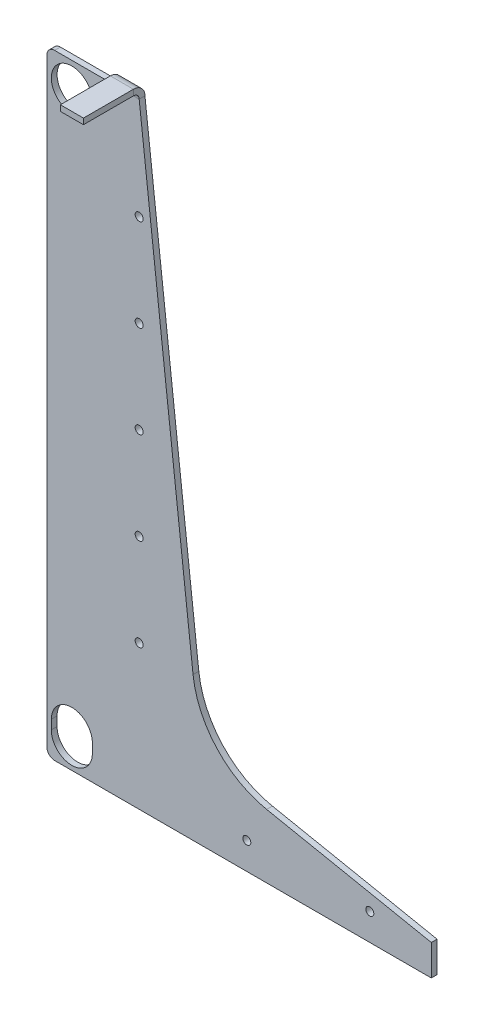
ISO-10303-21;
HEADER;
FILE_DESCRIPTION(('STEP AP214'),'2;1');
FILE_NAME('part.step','',(''),(''),'','','');
FILE_SCHEMA(('AUTOMOTIVE_DESIGN { 1 0 10303 214 1 1 1 1 }'));
ENDSEC;
DATA;
#1=APPLICATION_CONTEXT('core data for automotive mechanical design processes');
#2=APPLICATION_PROTOCOL_DEFINITION('international standard','automotive_design',2000,#1);
#3=PRODUCT_CONTEXT('',#1,'mechanical');
#4=PRODUCT('Part','Part','',(#3));
#5=PRODUCT_RELATED_PRODUCT_CATEGORY('part','',(#4));
#6=PRODUCT_DEFINITION_FORMATION('','',#4);
#7=PRODUCT_DEFINITION_CONTEXT('part definition',#1,'design');
#8=PRODUCT_DEFINITION('design','',#6,#7);
#9=PRODUCT_DEFINITION_SHAPE('','',#8);
#10=(LENGTH_UNIT() NAMED_UNIT(*) SI_UNIT(.MILLI.,.METRE.));
#11=(NAMED_UNIT(*) PLANE_ANGLE_UNIT() SI_UNIT($,.RADIAN.));
#12=(NAMED_UNIT(*) SI_UNIT($,.STERADIAN.) SOLID_ANGLE_UNIT());
#13=UNCERTAINTY_MEASURE_WITH_UNIT(LENGTH_MEASURE(1.E-05),#10,'distance_accuracy_value','');
#14=(GEOMETRIC_REPRESENTATION_CONTEXT(3) GLOBAL_UNCERTAINTY_ASSIGNED_CONTEXT((#13)) GLOBAL_UNIT_ASSIGNED_CONTEXT((#10,
#11,#12)) REPRESENTATION_CONTEXT('',''));
#15=CARTESIAN_POINT('',(0.,0.,0.));
#16=DIRECTION('',(0.,0.,1.));
#17=DIRECTION('',(1.,0.,0.));
#18=AXIS2_PLACEMENT_3D('',#15,#16,#17);
#19=CARTESIAN_POINT('',(6.35,508.,3.175));
#20=DIRECTION('',(0.,-1.,0.));
#21=DIRECTION('',(-1.,0.,0.));
#22=AXIS2_PLACEMENT_3D('',#19,#20,#21);
#23=PLANE('',#22);
#24=DIRECTION('',(-1.,0.,0.));
#25=VECTOR('',#24,1.);
#26=CARTESIAN_POINT('',(6.35,508.,3.175));
#27=LINE('',#26,#25);
#28=CARTESIAN_POINT('',(57.15,508.,3.17500000000017));
#29=VERTEX_POINT('',#28);
#30=CARTESIAN_POINT('',(6.35,508.,3.175));
#31=VERTEX_POINT('',#30);
#32=EDGE_CURVE('E316',#29,#31,#27,.T.);
#33=ORIENTED_EDGE('',*,*,#32,.F.);
#34=DIRECTION('',(0.,0.,-1.));
#35=VECTOR('',#34,1.);
#36=CARTESIAN_POINT('',(57.15,508.,3.17500000000017));
#37=LINE('',#36,#35);
#38=CARTESIAN_POINT('',(57.15,508.,-1.5875));
#39=VERTEX_POINT('',#38);
#40=EDGE_CURVE('E287',#29,#39,#37,.T.);
#41=ORIENTED_EDGE('',*,*,#40,.T.);
#42=DIRECTION('',(-1.,0.,0.));
#43=VECTOR('',#42,1.);
#44=CARTESIAN_POINT('',(6.35,508.,-1.5875));
#45=LINE('',#44,#43);
#46=CARTESIAN_POINT('',(6.35,508.,-1.5875));
#47=VERTEX_POINT('',#46);
#48=EDGE_CURVE('E353',#39,#47,#45,.T.);
#49=ORIENTED_EDGE('',*,*,#48,.T.);
#50=DIRECTION('',(0.,0.,1.));
#51=VECTOR('',#50,1.);
#52=CARTESIAN_POINT('',(6.35,508.,3.175));
#53=LINE('',#52,#51);
#54=EDGE_CURVE('E370',#47,#31,#53,.T.);
#55=ORIENTED_EDGE('',*,*,#54,.T.);
#56=EDGE_LOOP('',(#33,#41,#49,#55));
#57=FACE_BOUND('',#56,.T.);
#58=ADVANCED_FACE('F54',(#57),#23,.F.);
#59=CARTESIAN_POINT('',(196.401298520813,127.328797682991,3.175));
#60=DIRECTION('',(0.,0.,-1.));
#61=DIRECTION('',(-1.,0.,0.));
#62=AXIS2_PLACEMENT_3D('',#59,#60,#61);
#63=CYLINDRICAL_SURFACE('',#62,76.2);
#64=DIRECTION('',(0.,0.,1.));
#65=VECTOR('',#64,1.);
#66=CARTESIAN_POINT('',(181.457249023283,52.6085501953433,3.175));
#67=LINE('',#66,#65);
#68=CARTESIAN_POINT('',(181.457249023283,52.6085501953433,-1.5875));
#69=VERTEX_POINT('',#68);
#70=CARTESIAN_POINT('',(181.457249023283,52.6085501953433,3.175));
#71=VERTEX_POINT('',#70);
#72=EDGE_CURVE('E13',#69,#71,#67,.T.);
#73=ORIENTED_EDGE('',*,*,#72,.F.);
#74=CARTESIAN_POINT('',(196.401298520813,127.328797682991,-1.5875));
#75=DIRECTION('',(0.,0.,-1.));
#76=DIRECTION('',(-1.,0.,0.));
#77=AXIS2_PLACEMENT_3D('',#74,#75,#76);
#78=CIRCLE('',#77,76.2);
#79=CARTESIAN_POINT('',(120.694108864395,118.676547436544,-1.5875));
#80=VERTEX_POINT('',#79);
#81=EDGE_CURVE('E357',#69,#80,#78,.T.);
#82=ORIENTED_EDGE('',*,*,#81,.T.);
#83=DIRECTION('',(0.,0.,1.));
#84=VECTOR('',#83,1.);
#85=CARTESIAN_POINT('',(120.694108864395,118.676547436544,3.175));
#86=LINE('',#85,#84);
#87=CARTESIAN_POINT('',(120.694108864395,118.676547436544,3.175));
#88=VERTEX_POINT('',#87);
#89=EDGE_CURVE('E63',#80,#88,#86,.T.);
#90=ORIENTED_EDGE('',*,*,#89,.T.);
#91=CARTESIAN_POINT('',(196.401298520813,127.328797682991,3.175));
#92=DIRECTION('',(0.,0.,-1.));
#93=DIRECTION('',(1.,0.,0.));
#94=AXIS2_PLACEMENT_3D('',#91,#92,#93);
#95=CIRCLE('',#94,76.2);
#96=EDGE_CURVE('E310',#71,#88,#95,.T.);
#97=ORIENTED_EDGE('',*,*,#96,.F.);
#98=EDGE_LOOP('',(#73,#82,#90,#97));
#99=FACE_BOUND('',#98,.T.);
#100=ADVANCED_FACE('F378',(#99),#63,.F.);
#101=CARTESIAN_POINT('',(76.2,508.,3.175));
#102=DIRECTION('',(-0.993532672656404,-0.113546591160732,0.));
#103=DIRECTION('',(-0.113546591160732,0.993532672656404,0.));
#104=AXIS2_PLACEMENT_3D('',#101,#102,#103);
#105=PLANE('',#104);
#106=ORIENTED_EDGE('',*,*,#89,.F.);
#107=DIRECTION('',(-0.113546591160732,0.993532672656404,0.));
#108=VECTOR('',#107,1.);
#109=CARTESIAN_POINT('',(76.2,508.,-1.5875));
#110=LINE('',#109,#108);
#111=CARTESIAN_POINT('',(76.2,508.,-1.58749999999994));
#112=VERTEX_POINT('',#111);
#113=EDGE_CURVE('E354',#80,#112,#110,.T.);
#114=ORIENTED_EDGE('',*,*,#113,.T.);
#115=DIRECTION('',(0.,0.,1.));
#116=VECTOR('',#115,1.);
#117=CARTESIAN_POINT('',(76.2,508.,3.175));
#118=LINE('',#117,#116);
#119=CARTESIAN_POINT('',(76.2,508.,3.17500000000006));
#120=VERTEX_POINT('',#119);
#121=EDGE_CURVE('E373',#112,#120,#118,.T.);
#122=ORIENTED_EDGE('',*,*,#121,.T.);
#123=DIRECTION('',(-0.113546591160732,0.993532672656404,0.));
#124=VECTOR('',#123,1.);
#125=CARTESIAN_POINT('',(76.2,508.,3.175));
#126=LINE('',#125,#124);
#127=EDGE_CURVE('E313',#88,#120,#126,.T.);
#128=ORIENTED_EDGE('',*,*,#127,.F.);
#129=EDGE_LOOP('',(#106,#114,#122,#128));
#130=FACE_BOUND('',#129,.T.);
#131=ADVANCED_FACE('F386',(#130),#105,.F.);
#132=CARTESIAN_POINT('',(6.35,501.65,3.175));
#133=DIRECTION('',(0.,0.,1.));
#134=DIRECTION('',(1.,0.,0.));
#135=AXIS2_PLACEMENT_3D('',#132,#133,#134);
#136=CYLINDRICAL_SURFACE('',#135,6.34999999999993);
#137=ORIENTED_EDGE('',*,*,#54,.F.);
#138=CARTESIAN_POINT('',(6.35,501.65,-1.5875));
#139=DIRECTION('',(0.,0.,1.));
#140=DIRECTION('',(1.,0.,0.));
#141=AXIS2_PLACEMENT_3D('',#138,#139,#140);
#142=CIRCLE('',#141,6.34999999999993);
#143=CARTESIAN_POINT('',(0.,501.65,-1.5875));
#144=VERTEX_POINT('',#143);
#145=EDGE_CURVE('E348',#47,#144,#142,.T.);
#146=ORIENTED_EDGE('',*,*,#145,.T.);
#147=DIRECTION('',(0.,0.,1.));
#148=VECTOR('',#147,1.);
#149=CARTESIAN_POINT('',(0.,501.65,3.175));
#150=LINE('',#149,#148);
#151=CARTESIAN_POINT('',(0.,501.65,3.175));
#152=VERTEX_POINT('',#151);
#153=EDGE_CURVE('E368',#144,#152,#150,.T.);
#154=ORIENTED_EDGE('',*,*,#153,.T.);
#155=CARTESIAN_POINT('',(6.35,501.65,3.175));
#156=DIRECTION('',(0.,0.,1.));
#157=DIRECTION('',(-1.,0.,0.));
#158=AXIS2_PLACEMENT_3D('',#155,#156,#157);
#159=CIRCLE('',#158,6.34999999999993);
#160=EDGE_CURVE('E320',#31,#152,#159,.T.);
#161=ORIENTED_EDGE('',*,*,#160,.F.);
#162=EDGE_LOOP('',(#137,#146,#154,#161));
#163=FACE_BOUND('',#162,.T.);
#164=ADVANCED_FACE('F405',(#163),#136,.T.);
#165=CARTESIAN_POINT('',(0.,6.35,3.175));
#166=DIRECTION('',(1.,0.,0.));
#167=DIRECTION('',(0.,-1.,0.));
#168=AXIS2_PLACEMENT_3D('',#165,#166,#167);
#169=PLANE('',#168);
#170=ORIENTED_EDGE('',*,*,#153,.F.);
#171=DIRECTION('',(0.,1.,0.));
#172=VECTOR('',#171,1.);
#173=CARTESIAN_POINT('',(0.,6.35,-1.5875));
#174=LINE('',#173,#172);
#175=CARTESIAN_POINT('',(0.,6.35,-1.5875));
#176=VERTEX_POINT('',#175);
#177=EDGE_CURVE('E345',#144,#176,#174,.F.);
#178=ORIENTED_EDGE('',*,*,#177,.T.);
#179=DIRECTION('',(0.,0.,1.));
#180=VECTOR('',#179,1.);
#181=CARTESIAN_POINT('',(0.,6.35,3.175));
#182=LINE('',#181,#180);
#183=CARTESIAN_POINT('',(0.,6.35,3.175));
#184=VERTEX_POINT('',#183);
#185=EDGE_CURVE('E366',#176,#184,#182,.T.);
#186=ORIENTED_EDGE('',*,*,#185,.T.);
#187=DIRECTION('',(0.,-1.,0.));
#188=VECTOR('',#187,1.);
#189=CARTESIAN_POINT('',(0.,6.35,3.175));
#190=LINE('',#189,#188);
#191=EDGE_CURVE('E323',#152,#184,#190,.T.);
#192=ORIENTED_EDGE('',*,*,#191,.F.);
#193=EDGE_LOOP('',(#170,#178,#186,#192));
#194=FACE_BOUND('',#193,.T.);
#195=ADVANCED_FACE('F409',(#194),#169,.F.);
#196=CARTESIAN_POINT('',(6.35,6.35,3.175));
#197=DIRECTION('',(0.,0.,1.));
#198=DIRECTION('',(1.,0.,0.));
#199=AXIS2_PLACEMENT_3D('',#196,#197,#198);
#200=CYLINDRICAL_SURFACE('',#199,6.35);
#201=ORIENTED_EDGE('',*,*,#185,.F.);
#202=CARTESIAN_POINT('',(6.35,6.35,-1.5875));
#203=DIRECTION('',(0.,0.,1.));
#204=DIRECTION('',(1.,0.,0.));
#205=AXIS2_PLACEMENT_3D('',#202,#203,#204);
#206=CIRCLE('',#205,6.35);
#207=CARTESIAN_POINT('',(6.35,0.,-1.5875));
#208=VERTEX_POINT('',#207);
#209=EDGE_CURVE('E342',#176,#208,#206,.T.);
#210=ORIENTED_EDGE('',*,*,#209,.T.);
#211=DIRECTION('',(0.,0.,1.));
#212=VECTOR('',#211,1.);
#213=CARTESIAN_POINT('',(6.35,0.,3.175));
#214=LINE('',#213,#212);
#215=CARTESIAN_POINT('',(6.35,0.,3.175));
#216=VERTEX_POINT('',#215);
#217=EDGE_CURVE('E364',#208,#216,#214,.T.);
#218=ORIENTED_EDGE('',*,*,#217,.T.);
#219=CARTESIAN_POINT('',(6.35,6.35,3.175));
#220=DIRECTION('',(0.,0.,1.));
#221=DIRECTION('',(-1.,0.,0.));
#222=AXIS2_PLACEMENT_3D('',#219,#220,#221);
#223=CIRCLE('',#222,6.35);
#224=EDGE_CURVE('E326',#184,#216,#223,.T.);
#225=ORIENTED_EDGE('',*,*,#224,.F.);
#226=EDGE_LOOP('',(#201,#210,#218,#225));
#227=FACE_BOUND('',#226,.T.);
#228=ADVANCED_FACE('F412',(#227),#200,.T.);
#229=CARTESIAN_POINT('',(6.35,0.,3.175));
#230=DIRECTION('',(0.,1.,0.));
#231=DIRECTION('',(1.,0.,0.));
#232=AXIS2_PLACEMENT_3D('',#229,#230,#231);
#233=PLANE('',#232);
#234=ORIENTED_EDGE('',*,*,#217,.F.);
#235=DIRECTION('',(-1.,0.,0.));
#236=VECTOR('',#235,1.);
#237=CARTESIAN_POINT('',(6.35,0.,-1.5875));
#238=LINE('',#237,#236);
#239=CARTESIAN_POINT('',(317.5,0.,-1.5875));
#240=VERTEX_POINT('',#239);
#241=EDGE_CURVE('E301',#208,#240,#238,.F.);
#242=ORIENTED_EDGE('',*,*,#241,.T.);
#243=DIRECTION('',(0.,0.,1.));
#244=VECTOR('',#243,1.);
#245=CARTESIAN_POINT('',(317.5,0.,3.175));
#246=LINE('',#245,#244);
#247=CARTESIAN_POINT('',(317.5,0.,3.175));
#248=VERTEX_POINT('',#247);
#249=EDGE_CURVE('E362',#240,#248,#246,.T.);
#250=ORIENTED_EDGE('',*,*,#249,.T.);
#251=DIRECTION('',(1.,0.,0.));
#252=VECTOR('',#251,1.);
#253=CARTESIAN_POINT('',(6.35,0.,3.175));
#254=LINE('',#253,#252);
#255=EDGE_CURVE('E329',#216,#248,#254,.T.);
#256=ORIENTED_EDGE('',*,*,#255,.F.);
#257=EDGE_LOOP('',(#234,#242,#250,#256));
#258=FACE_BOUND('',#257,.T.);
#259=ADVANCED_FACE('F416',(#258),#233,.F.);
#260=CARTESIAN_POINT('',(317.5,25.4,3.175));
#261=DIRECTION('',(-1.,0.,0.));
#262=DIRECTION('',(0.,1.,0.));
#263=AXIS2_PLACEMENT_3D('',#260,#261,#262);
#264=PLANE('',#263);
#265=ORIENTED_EDGE('',*,*,#249,.F.);
#266=DIRECTION('',(0.,1.,0.));
#267=VECTOR('',#266,1.);
#268=CARTESIAN_POINT('',(317.5,6.35,-1.5875));
#269=LINE('',#268,#267);
#270=CARTESIAN_POINT('',(317.5,25.4,-1.5875));
#271=VERTEX_POINT('',#270);
#272=EDGE_CURVE('E336',#240,#271,#269,.T.);
#273=ORIENTED_EDGE('',*,*,#272,.T.);
#274=DIRECTION('',(0.,0.,1.));
#275=VECTOR('',#274,1.);
#276=CARTESIAN_POINT('',(317.5,25.4,3.175));
#277=LINE('',#276,#275);
#278=CARTESIAN_POINT('',(317.5,25.4,3.175));
#279=VERTEX_POINT('',#278);
#280=EDGE_CURVE('E58',#271,#279,#277,.T.);
#281=ORIENTED_EDGE('',*,*,#280,.T.);
#282=DIRECTION('',(0.,1.,0.));
#283=VECTOR('',#282,1.);
#284=CARTESIAN_POINT('',(317.5,25.4,3.175));
#285=LINE('',#284,#283);
#286=EDGE_CURVE('E304',#248,#279,#285,.T.);
#287=ORIENTED_EDGE('',*,*,#286,.F.);
#288=EDGE_LOOP('',(#265,#273,#281,#287));
#289=FACE_BOUND('',#288,.T.);
#290=ADVANCED_FACE('F421',(#289),#264,.F.);
#291=CARTESIAN_POINT('',(20.5739999999999,20.574,3.175));
#292=DIRECTION('',(0.,0.,1.));
#293=DIRECTION('',(1.,0.,0.));
#294=AXIS2_PLACEMENT_3D('',#291,#292,#293);
#295=CYLINDRICAL_SURFACE('',#294,16.9545);
#296=DIRECTION('',(0.,0.,1.));
#297=VECTOR('',#296,1.);
#298=CARTESIAN_POINT('',(37.5284999999999,20.574,-1.5875));
#299=LINE('',#298,#297);
#300=CARTESIAN_POINT('',(37.5284999999999,20.574,-1.5875));
#301=VERTEX_POINT('',#300);
#302=CARTESIAN_POINT('',(37.5284999999999,20.574,3.175));
#303=VERTEX_POINT('',#302);
#304=EDGE_CURVE('E210',#301,#303,#299,.T.);
#305=ORIENTED_EDGE('',*,*,#304,.F.);
#306=CARTESIAN_POINT('',(20.5739999999999,20.574,-1.5875));
#307=DIRECTION('',(0.,0.,1.));
#308=DIRECTION('',(1.,0.,0.));
#309=AXIS2_PLACEMENT_3D('',#306,#307,#308);
#310=CIRCLE('',#309,16.9545);
#311=CARTESIAN_POINT('',(3.61949999999991,20.5740000000002,-1.5875));
#312=VERTEX_POINT('',#311);
#313=EDGE_CURVE('E296',#312,#301,#310,.T.);
#314=ORIENTED_EDGE('',*,*,#313,.F.);
#315=DIRECTION('',(0.,0.,1.));
#316=VECTOR('',#315,1.);
#317=CARTESIAN_POINT('',(3.61949999999991,20.574,-1.5875));
#318=LINE('',#317,#316);
#319=CARTESIAN_POINT('',(3.61949999999991,20.574,3.175));
#320=VERTEX_POINT('',#319);
#321=EDGE_CURVE('E70',#312,#320,#318,.T.);
#322=ORIENTED_EDGE('',*,*,#321,.T.);
#323=CARTESIAN_POINT('',(20.5739999999999,20.574,3.175));
#324=DIRECTION('',(0.,0.,1.));
#325=DIRECTION('',(1.,0.,0.));
#326=AXIS2_PLACEMENT_3D('',#323,#324,#325);
#327=CIRCLE('',#326,16.9545);
#328=EDGE_CURVE('E297',#320,#303,#327,.T.);
#329=ORIENTED_EDGE('',*,*,#328,.T.);
#330=EDGE_LOOP('',(#305,#314,#322,#329));
#331=FACE_BOUND('',#330,.T.);
#332=ADVANCED_FACE('F423',(#331),#295,.F.);
#333=CARTESIAN_POINT('',(20.574,486.9942,3.175));
#334=DIRECTION('',(0.,0.,1.));
#335=DIRECTION('',(1.,0.,0.));
#336=AXIS2_PLACEMENT_3D('',#333,#334,#335);
#337=CYLINDRICAL_SURFACE('',#336,16.9545);
#338=CARTESIAN_POINT('',(20.574,486.9942,3.175));
#339=DIRECTION('',(0.,0.,1.));
#340=DIRECTION('',(1.,0.,0.));
#341=AXIS2_PLACEMENT_3D('',#338,#339,#340);
#342=CIRCLE('',#341,16.9545);
#343=CARTESIAN_POINT('',(37.5285,486.9942,3.175));
#344=VERTEX_POINT('',#343);
#345=EDGE_CURVE('E300',#344,#344,#342,.T.);
#346=ORIENTED_EDGE('',*,*,#345,.T.);
#347=EDGE_LOOP('',(#346));
#348=FACE_BOUND('',#347,.T.);
#349=CARTESIAN_POINT('',(20.574,486.9942,-1.5875));
#350=DIRECTION('',(0.,0.,1.));
#351=DIRECTION('',(1.,0.,0.));
#352=AXIS2_PLACEMENT_3D('',#349,#350,#351);
#353=CIRCLE('',#352,16.9545);
#354=CARTESIAN_POINT('',(37.5285,486.9942,-1.5875));
#355=VERTEX_POINT('',#354);
#356=EDGE_CURVE('E333',#355,#355,#353,.T.);
#357=ORIENTED_EDGE('',*,*,#356,.F.);
#358=EDGE_LOOP('',(#357));
#359=FACE_BOUND('',#358,.T.);
#360=ADVANCED_FACE('F429',(#348,#359),#337,.F.);
#361=CARTESIAN_POINT('',(181.457249023283,52.6085501953433,3.175));
#362=DIRECTION('',(-0.196116135138184,-0.98058067569092,0.));
#363=DIRECTION('',(-0.98058067569092,0.196116135138184,0.));
#364=AXIS2_PLACEMENT_3D('',#361,#362,#363);
#365=PLANE('',#364);
#366=DIRECTION('',(-0.98058067569092,0.196116135138184,0.));
#367=VECTOR('',#366,1.);
#368=CARTESIAN_POINT('',(181.457249023283,52.6085501953433,-1.5875));
#369=LINE('',#368,#367);
#370=EDGE_CURVE('E339',#271,#69,#369,.T.);
#371=ORIENTED_EDGE('',*,*,#370,.T.);
#372=ORIENTED_EDGE('',*,*,#72,.T.);
#373=DIRECTION('',(-0.98058067569092,0.196116135138184,0.));
#374=VECTOR('',#373,1.);
#375=CARTESIAN_POINT('',(181.457249023283,52.6085501953433,3.175));
#376=LINE('',#375,#374);
#377=EDGE_CURVE('E307',#279,#71,#376,.T.);
#378=ORIENTED_EDGE('',*,*,#377,.F.);
#379=ORIENTED_EDGE('',*,*,#280,.F.);
#380=EDGE_LOOP('',(#371,#372,#378,#379));
#381=FACE_BOUND('',#380,.T.);
#382=ADVANCED_FACE('F56',(#381),#365,.F.);
#383=CARTESIAN_POINT('',(6.35,6.35,3.175));
#384=DIRECTION('',(0.,0.,-1.));
#385=DIRECTION('',(-1.,0.,0.));
#386=AXIS2_PLACEMENT_3D('',#383,#384,#385);
#387=PLANE('',#386);
#388=CARTESIAN_POINT('',(165.1,22.2249999999996,3.175));
#389=DIRECTION('',(0.,0.,1.));
#390=DIRECTION('',(1.,0.,0.));
#391=AXIS2_PLACEMENT_3D('',#388,#389,#390);
#392=CIRCLE('',#391,3.30200000000001);
#393=CARTESIAN_POINT('',(168.402,22.2249999999996,3.175));
#394=VERTEX_POINT('',#393);
#395=EDGE_CURVE('E209',#394,#394,#392,.T.);
#396=ORIENTED_EDGE('',*,*,#395,.F.);
#397=EDGE_LOOP('',(#396));
#398=FACE_BOUND('',#397,.T.);
#399=CARTESIAN_POINT('',(266.7,22.2249999999996,3.175));
#400=DIRECTION('',(0.,0.,1.));
#401=DIRECTION('',(1.,0.,0.));
#402=AXIS2_PLACEMENT_3D('',#399,#400,#401);
#403=CIRCLE('',#402,3.30200000000004);
#404=CARTESIAN_POINT('',(270.002,22.2249999999996,3.175));
#405=VERTEX_POINT('',#404);
#406=EDGE_CURVE('E216',#405,#405,#403,.T.);
#407=ORIENTED_EDGE('',*,*,#406,.F.);
#408=EDGE_LOOP('',(#407));
#409=FACE_BOUND('',#408,.T.);
#410=CARTESIAN_POINT('',(76.2,119.092006341826,3.175));
#411=DIRECTION('',(0.,0.,1.));
#412=DIRECTION('',(1.,0.,0.));
#413=AXIS2_PLACEMENT_3D('',#410,#411,#412);
#414=CIRCLE('',#413,3.302);
#415=CARTESIAN_POINT('',(79.502,119.092006341826,3.175));
#416=VERTEX_POINT('',#415);
#417=EDGE_CURVE('E222',#416,#416,#414,.T.);
#418=ORIENTED_EDGE('',*,*,#417,.F.);
#419=EDGE_LOOP('',(#418));
#420=FACE_BOUND('',#419,.T.);
#421=CARTESIAN_POINT('',(76.2,195.292006341826,3.175));
#422=DIRECTION('',(0.,0.,1.));
#423=DIRECTION('',(1.,0.,0.));
#424=AXIS2_PLACEMENT_3D('',#421,#422,#423);
#425=CIRCLE('',#424,3.302);
#426=CARTESIAN_POINT('',(79.502,195.292006341826,3.175));
#427=VERTEX_POINT('',#426);
#428=EDGE_CURVE('E228',#427,#427,#425,.T.);
#429=ORIENTED_EDGE('',*,*,#428,.F.);
#430=EDGE_LOOP('',(#429));
#431=FACE_BOUND('',#430,.T.);
#432=CARTESIAN_POINT('',(76.2,271.492006341826,3.175));
#433=DIRECTION('',(0.,0.,1.));
#434=DIRECTION('',(1.,0.,0.));
#435=AXIS2_PLACEMENT_3D('',#432,#433,#434);
#436=CIRCLE('',#435,3.302);
#437=CARTESIAN_POINT('',(79.502,271.492006341826,3.175));
#438=VERTEX_POINT('',#437);
#439=EDGE_CURVE('E234',#438,#438,#436,.T.);
#440=ORIENTED_EDGE('',*,*,#439,.F.);
#441=EDGE_LOOP('',(#440));
#442=FACE_BOUND('',#441,.T.);
#443=CARTESIAN_POINT('',(76.2,347.692006341826,3.175));
#444=DIRECTION('',(0.,0.,1.));
#445=DIRECTION('',(1.,0.,0.));
#446=AXIS2_PLACEMENT_3D('',#443,#444,#445);
#447=CIRCLE('',#446,3.302);
#448=CARTESIAN_POINT('',(79.502,347.692006341826,3.175));
#449=VERTEX_POINT('',#448);
#450=EDGE_CURVE('E240',#449,#449,#447,.T.);
#451=ORIENTED_EDGE('',*,*,#450,.F.);
#452=EDGE_LOOP('',(#451));
#453=FACE_BOUND('',#452,.T.);
#454=CARTESIAN_POINT('',(76.2,423.892006341826,3.175));
#455=DIRECTION('',(0.,0.,1.));
#456=DIRECTION('',(1.,0.,0.));
#457=AXIS2_PLACEMENT_3D('',#454,#455,#456);
#458=CIRCLE('',#457,3.302);
#459=CARTESIAN_POINT('',(79.502,423.892006341826,3.175));
#460=VERTEX_POINT('',#459);
#461=EDGE_CURVE('E246',#460,#460,#458,.T.);
#462=ORIENTED_EDGE('',*,*,#461,.F.);
#463=EDGE_LOOP('',(#462));
#464=FACE_BOUND('',#463,.T.);
#465=CARTESIAN_POINT('',(20.574,28.2067,3.175));
#466=DIRECTION('',(0.,0.,1.));
#467=DIRECTION('',(1.,0.,0.));
#468=AXIS2_PLACEMENT_3D('',#465,#466,#467);
#469=CIRCLE('',#468,16.9545);
#470=CARTESIAN_POINT('',(37.5285,28.2067,3.175));
#471=VERTEX_POINT('',#470);
#472=CARTESIAN_POINT('',(3.61949999999999,28.2067,3.175));
#473=VERTEX_POINT('',#472);
#474=EDGE_CURVE('E186',#471,#473,#469,.T.);
#475=ORIENTED_EDGE('',*,*,#474,.F.);
#476=DIRECTION('',(0.,1.,0.));
#477=VECTOR('',#476,1.);
#478=CARTESIAN_POINT('',(37.5285,28.2067,3.175));
#479=LINE('',#478,#477);
#480=EDGE_CURVE('E198',#303,#471,#479,.T.);
#481=ORIENTED_EDGE('',*,*,#480,.F.);
#482=ORIENTED_EDGE('',*,*,#328,.F.);
#483=DIRECTION('',(0.,-1.,0.));
#484=VECTOR('',#483,1.);
#485=CARTESIAN_POINT('',(3.61949999999999,28.2067,3.175));
#486=LINE('',#485,#484);
#487=EDGE_CURVE('E201',#473,#320,#486,.T.);
#488=ORIENTED_EDGE('',*,*,#487,.F.);
#489=EDGE_LOOP('',(#475,#481,#482,#488));
#490=FACE_BOUND('',#489,.T.);
#491=ORIENTED_EDGE('',*,*,#345,.F.);
#492=EDGE_LOOP('',(#491));
#493=FACE_BOUND('',#492,.T.);
#494=ORIENTED_EDGE('',*,*,#286,.T.);
#495=ORIENTED_EDGE('',*,*,#377,.T.);
#496=ORIENTED_EDGE('',*,*,#96,.T.);
#497=ORIENTED_EDGE('',*,*,#127,.T.);
#498=EDGE_CURVE('E317',#120,#29,#27,.T.);
#499=ORIENTED_EDGE('',*,*,#498,.T.);
#500=ORIENTED_EDGE('',*,*,#32,.T.);
#501=ORIENTED_EDGE('',*,*,#160,.T.);
#502=ORIENTED_EDGE('',*,*,#191,.T.);
#503=ORIENTED_EDGE('',*,*,#224,.T.);
#504=ORIENTED_EDGE('',*,*,#255,.T.);
#505=EDGE_LOOP('',(#494,#495,#496,#497,#499,#500,#501,#502,#503,#504));
#506=FACE_BOUND('',#505,.T.);
#507=ADVANCED_FACE('F384',(#398,#409,#420,#431,#442,#453,#464,#490,#493,#506),#387,.F.);
#508=CARTESIAN_POINT('',(6.35,6.35,-1.5875));
#509=DIRECTION('',(0.,0.,-1.));
#510=DIRECTION('',(-1.,0.,0.));
#511=AXIS2_PLACEMENT_3D('',#508,#509,#510);
#512=PLANE('',#511);
#513=DIRECTION('',(0.,1.,0.));
#514=VECTOR('',#513,1.);
#515=CARTESIAN_POINT('',(37.5285,28.2067,-1.5875));
#516=LINE('',#515,#514);
#517=CARTESIAN_POINT('',(37.5285,28.2067,-1.5875));
#518=VERTEX_POINT('',#517);
#519=EDGE_CURVE('E188',#301,#518,#516,.T.);
#520=ORIENTED_EDGE('',*,*,#519,.T.);
#521=CARTESIAN_POINT('',(20.574,28.2067,-1.5875));
#522=DIRECTION('',(0.,0.,1.));
#523=DIRECTION('',(1.,0.,0.));
#524=AXIS2_PLACEMENT_3D('',#521,#522,#523);
#525=CIRCLE('',#524,16.9545);
#526=CARTESIAN_POINT('',(3.61949999999999,28.2067,-1.5875));
#527=VERTEX_POINT('',#526);
#528=EDGE_CURVE('E183',#518,#527,#525,.T.);
#529=ORIENTED_EDGE('',*,*,#528,.T.);
#530=DIRECTION('',(0.,-1.,0.));
#531=VECTOR('',#530,1.);
#532=CARTESIAN_POINT('',(3.61949999999999,28.2067,-1.5875));
#533=LINE('',#532,#531);
#534=EDGE_CURVE('E190',#527,#312,#533,.T.);
#535=ORIENTED_EDGE('',*,*,#534,.T.);
#536=ORIENTED_EDGE('',*,*,#313,.T.);
#537=EDGE_LOOP('',(#520,#529,#535,#536));
#538=FACE_BOUND('',#537,.T.);
#539=CARTESIAN_POINT('',(165.1,22.2249999999996,-1.5875));
#540=DIRECTION('',(0.,0.,1.));
#541=DIRECTION('',(1.,0.,0.));
#542=AXIS2_PLACEMENT_3D('',#539,#540,#541);
#543=CIRCLE('',#542,3.30200000000001);
#544=CARTESIAN_POINT('',(168.402,22.2249999999996,-1.5875));
#545=VERTEX_POINT('',#544);
#546=EDGE_CURVE('E213',#545,#545,#543,.T.);
#547=ORIENTED_EDGE('',*,*,#546,.T.);
#548=EDGE_LOOP('',(#547));
#549=FACE_BOUND('',#548,.T.);
#550=CARTESIAN_POINT('',(266.7,22.2249999999996,-1.5875));
#551=DIRECTION('',(0.,0.,1.));
#552=DIRECTION('',(1.,0.,0.));
#553=AXIS2_PLACEMENT_3D('',#550,#551,#552);
#554=CIRCLE('',#553,3.30200000000004);
#555=CARTESIAN_POINT('',(270.002,22.2249999999996,-1.5875));
#556=VERTEX_POINT('',#555);
#557=EDGE_CURVE('E219',#556,#556,#554,.T.);
#558=ORIENTED_EDGE('',*,*,#557,.T.);
#559=EDGE_LOOP('',(#558));
#560=FACE_BOUND('',#559,.T.);
#561=CARTESIAN_POINT('',(76.2,119.092006341826,-1.5875));
#562=DIRECTION('',(0.,0.,1.));
#563=DIRECTION('',(1.,0.,0.));
#564=AXIS2_PLACEMENT_3D('',#561,#562,#563);
#565=CIRCLE('',#564,3.302);
#566=CARTESIAN_POINT('',(79.502,119.092006341826,-1.5875));
#567=VERTEX_POINT('',#566);
#568=EDGE_CURVE('E225',#567,#567,#565,.T.);
#569=ORIENTED_EDGE('',*,*,#568,.T.);
#570=EDGE_LOOP('',(#569));
#571=FACE_BOUND('',#570,.T.);
#572=CARTESIAN_POINT('',(76.2,195.292006341826,-1.5875));
#573=DIRECTION('',(0.,0.,1.));
#574=DIRECTION('',(1.,0.,0.));
#575=AXIS2_PLACEMENT_3D('',#572,#573,#574);
#576=CIRCLE('',#575,3.302);
#577=CARTESIAN_POINT('',(79.502,195.292006341826,-1.5875));
#578=VERTEX_POINT('',#577);
#579=EDGE_CURVE('E231',#578,#578,#576,.T.);
#580=ORIENTED_EDGE('',*,*,#579,.T.);
#581=EDGE_LOOP('',(#580));
#582=FACE_BOUND('',#581,.T.);
#583=CARTESIAN_POINT('',(76.2,271.492006341826,-1.5875));
#584=DIRECTION('',(0.,0.,1.));
#585=DIRECTION('',(1.,0.,0.));
#586=AXIS2_PLACEMENT_3D('',#583,#584,#585);
#587=CIRCLE('',#586,3.302);
#588=CARTESIAN_POINT('',(79.502,271.492006341826,-1.5875));
#589=VERTEX_POINT('',#588);
#590=EDGE_CURVE('E237',#589,#589,#587,.T.);
#591=ORIENTED_EDGE('',*,*,#590,.T.);
#592=EDGE_LOOP('',(#591));
#593=FACE_BOUND('',#592,.T.);
#594=CARTESIAN_POINT('',(76.2,347.692006341826,-1.5875));
#595=DIRECTION('',(0.,0.,1.));
#596=DIRECTION('',(1.,0.,0.));
#597=AXIS2_PLACEMENT_3D('',#594,#595,#596);
#598=CIRCLE('',#597,3.302);
#599=CARTESIAN_POINT('',(79.502,347.692006341826,-1.5875));
#600=VERTEX_POINT('',#599);
#601=EDGE_CURVE('E243',#600,#600,#598,.T.);
#602=ORIENTED_EDGE('',*,*,#601,.T.);
#603=EDGE_LOOP('',(#602));
#604=FACE_BOUND('',#603,.T.);
#605=CARTESIAN_POINT('',(76.2,423.892006341826,-1.5875));
#606=DIRECTION('',(0.,0.,1.));
#607=DIRECTION('',(1.,0.,0.));
#608=AXIS2_PLACEMENT_3D('',#605,#606,#607);
#609=CIRCLE('',#608,3.302);
#610=CARTESIAN_POINT('',(79.502,423.892006341826,-1.5875));
#611=VERTEX_POINT('',#610);
#612=EDGE_CURVE('E249',#611,#611,#609,.T.);
#613=ORIENTED_EDGE('',*,*,#612,.T.);
#614=EDGE_LOOP('',(#613));
#615=FACE_BOUND('',#614,.T.);
#616=ORIENTED_EDGE('',*,*,#356,.T.);
#617=EDGE_LOOP('',(#616));
#618=FACE_BOUND('',#617,.T.);
#619=ORIENTED_EDGE('',*,*,#272,.F.);
#620=ORIENTED_EDGE('',*,*,#241,.F.);
#621=ORIENTED_EDGE('',*,*,#209,.F.);
#622=ORIENTED_EDGE('',*,*,#177,.F.);
#623=ORIENTED_EDGE('',*,*,#145,.F.);
#624=ORIENTED_EDGE('',*,*,#48,.F.);
#625=EDGE_CURVE('E351',#112,#39,#45,.T.);
#626=ORIENTED_EDGE('',*,*,#625,.F.);
#627=ORIENTED_EDGE('',*,*,#113,.F.);
#628=ORIENTED_EDGE('',*,*,#81,.F.);
#629=ORIENTED_EDGE('',*,*,#370,.F.);
#630=EDGE_LOOP('',(#619,#620,#621,#622,#623,#624,#626,#627,#628,#629));
#631=FACE_BOUND('',#630,.T.);
#632=ADVANCED_FACE('F196',(#538,#549,#560,#571,#582,#593,#604,#615,#618,#631),#512,.T.);
#633=CARTESIAN_POINT('',(76.2000000000001,508.,7.93750000000006));
#634=DIRECTION('',(1.,0.,0.));
#635=DIRECTION('',(0.,0.,-1.));
#636=AXIS2_PLACEMENT_3D('',#633,#634,#635);
#637=PLANE('',#636);
#638=DIRECTION('',(0.,-1.,0.));
#639=VECTOR('',#638,1.);
#640=CARTESIAN_POINT('',(76.2,517.525,7.93750000000002));
#641=LINE('',#640,#639);
#642=CARTESIAN_POINT('',(76.2000000000001,512.7625,7.93750000000004));
#643=VERTEX_POINT('',#642);
#644=CARTESIAN_POINT('',(76.2000000000001,517.525,7.93750000000002));
#645=VERTEX_POINT('',#644);
#646=EDGE_CURVE('E252',#643,#645,#641,.F.);
#647=ORIENTED_EDGE('',*,*,#646,.F.);
#648=CARTESIAN_POINT('',(76.2000000000001,508.,7.93750000000006));
#649=DIRECTION('',(-1.,0.,0.));
#650=DIRECTION('',(0.,0.,1.));
#651=AXIS2_PLACEMENT_3D('',#648,#649,#650);
#652=CIRCLE('',#651,4.7625);
#653=EDGE_CURVE('E289',#120,#643,#652,.F.);
#654=ORIENTED_EDGE('',*,*,#653,.F.);
#655=ORIENTED_EDGE('',*,*,#121,.F.);
#656=CARTESIAN_POINT('',(76.2000000000001,508.,7.93750000000006));
#657=DIRECTION('',(-1.,0.,0.));
#658=DIRECTION('',(0.,0.,1.));
#659=AXIS2_PLACEMENT_3D('',#656,#657,#658);
#660=CIRCLE('',#659,9.525);
#661=EDGE_CURVE('E284',#112,#645,#660,.F.);
#662=ORIENTED_EDGE('',*,*,#661,.T.);
#663=EDGE_LOOP('',(#647,#654,#655,#662));
#664=FACE_BOUND('',#663,.T.);
#665=ADVANCED_FACE('F390',(#664),#637,.T.);
#666=CARTESIAN_POINT('',(57.1500000000001,508.,7.93750000000017));
#667=DIRECTION('',(1.,0.,0.));
#668=DIRECTION('',(0.,0.,-1.));
#669=AXIS2_PLACEMENT_3D('',#666,#667,#668);
#670=PLANE('',#669);
#671=CARTESIAN_POINT('',(57.1500000000001,508.,7.93750000000017));
#672=DIRECTION('',(-1.,0.,0.));
#673=DIRECTION('',(0.,0.,1.));
#674=AXIS2_PLACEMENT_3D('',#671,#672,#673);
#675=CIRCLE('',#674,4.7625);
#676=CARTESIAN_POINT('',(57.1500000000001,512.7625,7.93750000000015));
#677=VERTEX_POINT('',#676);
#678=EDGE_CURVE('E258',#677,#29,#675,.T.);
#679=ORIENTED_EDGE('',*,*,#678,.F.);
#680=DIRECTION('',(0.,-1.,0.));
#681=VECTOR('',#680,1.);
#682=CARTESIAN_POINT('',(57.1500000000001,512.7625,7.93750000000015));
#683=LINE('',#682,#681);
#684=CARTESIAN_POINT('',(57.15,517.525,7.93750000000013));
#685=VERTEX_POINT('',#684);
#686=EDGE_CURVE('E278',#677,#685,#683,.F.);
#687=ORIENTED_EDGE('',*,*,#686,.T.);
#688=CARTESIAN_POINT('',(57.1500000000001,508.,7.93750000000017));
#689=DIRECTION('',(-1.,0.,0.));
#690=DIRECTION('',(0.,0.,1.));
#691=AXIS2_PLACEMENT_3D('',#688,#689,#690);
#692=CIRCLE('',#691,9.525);
#693=EDGE_CURVE('E78',#685,#39,#692,.T.);
#694=ORIENTED_EDGE('',*,*,#693,.T.);
#695=ORIENTED_EDGE('',*,*,#40,.F.);
#696=EDGE_LOOP('',(#679,#687,#694,#695));
#697=FACE_BOUND('',#696,.T.);
#698=ADVANCED_FACE('F506',(#697),#670,.F.);
#699=CARTESIAN_POINT('',(57.1500000000001,508.,7.93750000000017));
#700=DIRECTION('',(-1.,0.,0.));
#701=DIRECTION('',(0.,1.,0.));
#702=AXIS2_PLACEMENT_3D('',#699,#700,#701);
#703=CYLINDRICAL_SURFACE('',#702,9.525);
#704=ORIENTED_EDGE('',*,*,#625,.T.);
#705=ORIENTED_EDGE('',*,*,#693,.F.);
#706=DIRECTION('',(-1.,0.,0.));
#707=VECTOR('',#706,1.);
#708=CARTESIAN_POINT('',(76.2,517.525,7.93750000000002));
#709=LINE('',#708,#707);
#710=EDGE_CURVE('E276',#685,#645,#709,.F.);
#711=ORIENTED_EDGE('',*,*,#710,.T.);
#712=ORIENTED_EDGE('',*,*,#661,.F.);
#713=EDGE_LOOP('',(#704,#705,#711,#712));
#714=FACE_BOUND('',#713,.T.);
#715=ADVANCED_FACE('F393',(#714),#703,.T.);
#716=CARTESIAN_POINT('',(57.1500000000001,508.,7.93750000000017));
#717=DIRECTION('',(-1.,0.,0.));
#718=DIRECTION('',(0.,1.,0.));
#719=AXIS2_PLACEMENT_3D('',#716,#717,#718);
#720=CYLINDRICAL_SURFACE('',#719,4.7625);
#721=ORIENTED_EDGE('',*,*,#498,.F.);
#722=ORIENTED_EDGE('',*,*,#653,.T.);
#723=DIRECTION('',(-1.,0.,0.));
#724=VECTOR('',#723,1.);
#725=CARTESIAN_POINT('',(76.2,512.7625,7.93750000000004));
#726=LINE('',#725,#724);
#727=EDGE_CURVE('E280',#643,#677,#726,.T.);
#728=ORIENTED_EDGE('',*,*,#727,.T.);
#729=ORIENTED_EDGE('',*,*,#678,.T.);
#730=EDGE_LOOP('',(#721,#722,#728,#729));
#731=FACE_BOUND('',#730,.T.);
#732=ADVANCED_FACE('F525',(#731),#720,.F.);
#733=CARTESIAN_POINT('',(76.2,517.525,3.17499999999998));
#734=DIRECTION('',(-1.,0.,0.));
#735=DIRECTION('',(0.,-1.,0.));
#736=AXIS2_PLACEMENT_3D('',#733,#734,#735);
#737=PLANE('',#736);
#738=ORIENTED_EDGE('',*,*,#646,.T.);
#739=DIRECTION('',(0.,0.,-1.));
#740=VECTOR('',#739,1.);
#741=CARTESIAN_POINT('',(76.2,517.525,49.2125));
#742=LINE('',#741,#740);
#743=CARTESIAN_POINT('',(76.2,517.525,49.2125));
#744=VERTEX_POINT('',#743);
#745=EDGE_CURVE('E266',#744,#645,#742,.T.);
#746=ORIENTED_EDGE('',*,*,#745,.F.);
#747=DIRECTION('',(0.,-1.,0.));
#748=VECTOR('',#747,1.);
#749=CARTESIAN_POINT('',(76.2,517.525,49.2125));
#750=LINE('',#749,#748);
#751=CARTESIAN_POINT('',(76.2,512.7625,49.2125));
#752=VERTEX_POINT('',#751);
#753=EDGE_CURVE('E259',#744,#752,#750,.T.);
#754=ORIENTED_EDGE('',*,*,#753,.T.);
#755=DIRECTION('',(0.,0.,1.));
#756=VECTOR('',#755,1.);
#757=CARTESIAN_POINT('',(76.2,512.7625,3.17500000000001));
#758=LINE('',#757,#756);
#759=EDGE_CURVE('E273',#752,#643,#758,.F.);
#760=ORIENTED_EDGE('',*,*,#759,.T.);
#761=EDGE_LOOP('',(#738,#746,#754,#760));
#762=FACE_BOUND('',#761,.T.);
#763=ADVANCED_FACE('F535',(#762),#737,.F.);
#764=CARTESIAN_POINT('',(57.15,517.525,49.2125));
#765=DIRECTION('',(1.,0.,0.));
#766=DIRECTION('',(0.,1.,0.));
#767=AXIS2_PLACEMENT_3D('',#764,#765,#766);
#768=PLANE('',#767);
#769=ORIENTED_EDGE('',*,*,#686,.F.);
#770=DIRECTION('',(0.,0.,-1.));
#771=VECTOR('',#770,1.);
#772=CARTESIAN_POINT('',(57.1500000000001,512.7625,49.2125));
#773=LINE('',#772,#771);
#774=CARTESIAN_POINT('',(57.1500000000001,512.7625,49.2125));
#775=VERTEX_POINT('',#774);
#776=EDGE_CURVE('E271',#677,#775,#773,.F.);
#777=ORIENTED_EDGE('',*,*,#776,.T.);
#778=DIRECTION('',(0.,-1.,0.));
#779=VECTOR('',#778,1.);
#780=CARTESIAN_POINT('',(57.15,517.525,49.2125));
#781=LINE('',#780,#779);
#782=CARTESIAN_POINT('',(57.15,517.525,49.2125));
#783=VERTEX_POINT('',#782);
#784=EDGE_CURVE('E255',#783,#775,#781,.T.);
#785=ORIENTED_EDGE('',*,*,#784,.F.);
#786=DIRECTION('',(0.,0.,1.));
#787=VECTOR('',#786,1.);
#788=CARTESIAN_POINT('',(57.15,517.525,49.2125));
#789=LINE('',#788,#787);
#790=EDGE_CURVE('E264',#685,#783,#789,.T.);
#791=ORIENTED_EDGE('',*,*,#790,.F.);
#792=EDGE_LOOP('',(#769,#777,#785,#791));
#793=FACE_BOUND('',#792,.T.);
#794=ADVANCED_FACE('F546',(#793),#768,.F.);
#795=CARTESIAN_POINT('',(76.2,517.525,49.2125));
#796=DIRECTION('',(0.,-1.,0.));
#797=DIRECTION('',(1.,0.,0.));
#798=AXIS2_PLACEMENT_3D('',#795,#796,#797);
#799=PLANE('',#798);
#800=ORIENTED_EDGE('',*,*,#710,.F.);
#801=ORIENTED_EDGE('',*,*,#790,.T.);
#802=DIRECTION('',(1.,0.,0.));
#803=VECTOR('',#802,1.);
#804=CARTESIAN_POINT('',(76.2,517.525,49.2125));
#805=LINE('',#804,#803);
#806=EDGE_CURVE('E262',#783,#744,#805,.T.);
#807=ORIENTED_EDGE('',*,*,#806,.T.);
#808=ORIENTED_EDGE('',*,*,#745,.T.);
#809=EDGE_LOOP('',(#800,#801,#807,#808));
#810=FACE_BOUND('',#809,.T.);
#811=ADVANCED_FACE('F557',(#810),#799,.F.);
#812=CARTESIAN_POINT('',(76.2,512.7625,49.2125));
#813=DIRECTION('',(0.,-1.,0.));
#814=DIRECTION('',(1.,0.,0.));
#815=AXIS2_PLACEMENT_3D('',#812,#813,#814);
#816=PLANE('',#815);
#817=ORIENTED_EDGE('',*,*,#776,.F.);
#818=ORIENTED_EDGE('',*,*,#727,.F.);
#819=ORIENTED_EDGE('',*,*,#759,.F.);
#820=DIRECTION('',(-1.,0.,0.));
#821=VECTOR('',#820,1.);
#822=CARTESIAN_POINT('',(76.2,512.7625,49.2125));
#823=LINE('',#822,#821);
#824=EDGE_CURVE('E269',#775,#752,#823,.F.);
#825=ORIENTED_EDGE('',*,*,#824,.F.);
#826=EDGE_LOOP('',(#817,#818,#819,#825));
#827=FACE_BOUND('',#826,.T.);
#828=ADVANCED_FACE('F568',(#827),#816,.T.);
#829=CARTESIAN_POINT('',(76.2,517.525,49.2125));
#830=DIRECTION('',(0.,0.,-1.));
#831=DIRECTION('',(0.,1.,0.));
#832=AXIS2_PLACEMENT_3D('',#829,#830,#831);
#833=PLANE('',#832);
#834=ORIENTED_EDGE('',*,*,#824,.T.);
#835=ORIENTED_EDGE('',*,*,#753,.F.);
#836=ORIENTED_EDGE('',*,*,#806,.F.);
#837=ORIENTED_EDGE('',*,*,#784,.T.);
#838=EDGE_LOOP('',(#834,#835,#836,#837));
#839=FACE_BOUND('',#838,.T.);
#840=ADVANCED_FACE('F579',(#839),#833,.F.);
#841=CARTESIAN_POINT('',(76.2,423.892006341826,-1.5875));
#842=DIRECTION('',(0.,0.,1.));
#843=DIRECTION('',(1.,0.,0.));
#844=AXIS2_PLACEMENT_3D('',#841,#842,#843);
#845=CYLINDRICAL_SURFACE('',#844,3.302);
#846=ORIENTED_EDGE('',*,*,#612,.F.);
#847=EDGE_LOOP('',(#846));
#848=FACE_BOUND('',#847,.T.);
#849=ORIENTED_EDGE('',*,*,#461,.T.);
#850=EDGE_LOOP('',(#849));
#851=FACE_BOUND('',#850,.T.);
#852=ADVANCED_FACE('F590',(#848,#851),#845,.F.);
#853=CARTESIAN_POINT('',(76.2,347.692006341826,-1.5875));
#854=DIRECTION('',(0.,0.,1.));
#855=DIRECTION('',(1.,0.,0.));
#856=AXIS2_PLACEMENT_3D('',#853,#854,#855);
#857=CYLINDRICAL_SURFACE('',#856,3.302);
#858=ORIENTED_EDGE('',*,*,#601,.F.);
#859=EDGE_LOOP('',(#858));
#860=FACE_BOUND('',#859,.T.);
#861=ORIENTED_EDGE('',*,*,#450,.T.);
#862=EDGE_LOOP('',(#861));
#863=FACE_BOUND('',#862,.T.);
#864=ADVANCED_FACE('F601',(#860,#863),#857,.F.);
#865=CARTESIAN_POINT('',(76.2,271.492006341826,-1.5875));
#866=DIRECTION('',(0.,0.,1.));
#867=DIRECTION('',(1.,0.,0.));
#868=AXIS2_PLACEMENT_3D('',#865,#866,#867);
#869=CYLINDRICAL_SURFACE('',#868,3.302);
#870=ORIENTED_EDGE('',*,*,#590,.F.);
#871=EDGE_LOOP('',(#870));
#872=FACE_BOUND('',#871,.T.);
#873=ORIENTED_EDGE('',*,*,#439,.T.);
#874=EDGE_LOOP('',(#873));
#875=FACE_BOUND('',#874,.T.);
#876=ADVANCED_FACE('F611',(#872,#875),#869,.F.);
#877=CARTESIAN_POINT('',(76.2,195.292006341826,-1.5875));
#878=DIRECTION('',(0.,0.,1.));
#879=DIRECTION('',(1.,0.,0.));
#880=AXIS2_PLACEMENT_3D('',#877,#878,#879);
#881=CYLINDRICAL_SURFACE('',#880,3.302);
#882=ORIENTED_EDGE('',*,*,#579,.F.);
#883=EDGE_LOOP('',(#882));
#884=FACE_BOUND('',#883,.T.);
#885=ORIENTED_EDGE('',*,*,#428,.T.);
#886=EDGE_LOOP('',(#885));
#887=FACE_BOUND('',#886,.T.);
#888=ADVANCED_FACE('F621',(#884,#887),#881,.F.);
#889=CARTESIAN_POINT('',(76.2,119.092006341826,-1.5875));
#890=DIRECTION('',(0.,0.,1.));
#891=DIRECTION('',(1.,0.,0.));
#892=AXIS2_PLACEMENT_3D('',#889,#890,#891);
#893=CYLINDRICAL_SURFACE('',#892,3.302);
#894=ORIENTED_EDGE('',*,*,#568,.F.);
#895=EDGE_LOOP('',(#894));
#896=FACE_BOUND('',#895,.T.);
#897=ORIENTED_EDGE('',*,*,#417,.T.);
#898=EDGE_LOOP('',(#897));
#899=FACE_BOUND('',#898,.T.);
#900=ADVANCED_FACE('F631',(#896,#899),#893,.F.);
#901=CARTESIAN_POINT('',(266.7,22.2249999999996,-1.5875));
#902=DIRECTION('',(0.,0.,1.));
#903=DIRECTION('',(1.,0.,0.));
#904=AXIS2_PLACEMENT_3D('',#901,#902,#903);
#905=CYLINDRICAL_SURFACE('',#904,3.30200000000004);
#906=ORIENTED_EDGE('',*,*,#557,.F.);
#907=EDGE_LOOP('',(#906));
#908=FACE_BOUND('',#907,.T.);
#909=ORIENTED_EDGE('',*,*,#406,.T.);
#910=EDGE_LOOP('',(#909));
#911=FACE_BOUND('',#910,.T.);
#912=ADVANCED_FACE('F641',(#908,#911),#905,.F.);
#913=CARTESIAN_POINT('',(165.1,22.2249999999996,-1.5875));
#914=DIRECTION('',(0.,0.,1.));
#915=DIRECTION('',(1.,0.,0.));
#916=AXIS2_PLACEMENT_3D('',#913,#914,#915);
#917=CYLINDRICAL_SURFACE('',#916,3.30200000000001);
#918=ORIENTED_EDGE('',*,*,#546,.F.);
#919=EDGE_LOOP('',(#918));
#920=FACE_BOUND('',#919,.T.);
#921=ORIENTED_EDGE('',*,*,#395,.T.);
#922=EDGE_LOOP('',(#921));
#923=FACE_BOUND('',#922,.T.);
#924=ADVANCED_FACE('F651',(#920,#923),#917,.F.);
#925=CARTESIAN_POINT('',(20.574,28.2067,-1.5875));
#926=DIRECTION('',(0.,0.,1.));
#927=DIRECTION('',(1.,0.,0.));
#928=AXIS2_PLACEMENT_3D('',#925,#926,#927);
#929=CYLINDRICAL_SURFACE('',#928,16.9545);
#930=ORIENTED_EDGE('',*,*,#474,.T.);
#931=DIRECTION('',(0.,0.,1.));
#932=VECTOR('',#931,1.);
#933=CARTESIAN_POINT('',(3.61949999999999,28.2067,-1.5875));
#934=LINE('',#933,#932);
#935=EDGE_CURVE('E180',#527,#473,#934,.T.);
#936=ORIENTED_EDGE('',*,*,#935,.F.);
#937=ORIENTED_EDGE('',*,*,#528,.F.);
#938=DIRECTION('',(0.,0.,1.));
#939=VECTOR('',#938,1.);
#940=CARTESIAN_POINT('',(37.5285,28.2067,-1.5875));
#941=LINE('',#940,#939);
#942=EDGE_CURVE('E207',#518,#471,#941,.T.);
#943=ORIENTED_EDGE('',*,*,#942,.T.);
#944=EDGE_LOOP('',(#930,#936,#937,#943));
#945=FACE_BOUND('',#944,.T.);
#946=ADVANCED_FACE('F181',(#945),#929,.F.);
#947=CARTESIAN_POINT('',(37.5285,28.2067,-1.5875));
#948=DIRECTION('',(1.,0.,0.));
#949=DIRECTION('',(0.,1.,0.));
#950=AXIS2_PLACEMENT_3D('',#947,#948,#949);
#951=PLANE('',#950);
#952=ORIENTED_EDGE('',*,*,#480,.T.);
#953=ORIENTED_EDGE('',*,*,#942,.F.);
#954=ORIENTED_EDGE('',*,*,#519,.F.);
#955=ORIENTED_EDGE('',*,*,#304,.T.);
#956=EDGE_LOOP('',(#952,#953,#954,#955));
#957=FACE_BOUND('',#956,.T.);
#958=ADVANCED_FACE('F692',(#957),#951,.F.);
#959=CARTESIAN_POINT('',(3.61949999999999,28.2067,-1.5875));
#960=DIRECTION('',(-1.,0.,0.));
#961=DIRECTION('',(0.,-1.,0.));
#962=AXIS2_PLACEMENT_3D('',#959,#960,#961);
#963=PLANE('',#962);
#964=ORIENTED_EDGE('',*,*,#487,.T.);
#965=ORIENTED_EDGE('',*,*,#321,.F.);
#966=ORIENTED_EDGE('',*,*,#534,.F.);
#967=ORIENTED_EDGE('',*,*,#935,.T.);
#968=EDGE_LOOP('',(#964,#965,#966,#967));
#969=FACE_BOUND('',#968,.T.);
#970=ADVANCED_FACE('F191',(#969),#963,.F.);
#971=CLOSED_SHELL('',(#58,#100,#131,#164,#195,#228,#259,#290,#332,#360,#382,#507,#632,#665,#698,
#715,#732,#763,#794,#811,#828,#840,#852,#864,#876,#888,#900,#912,#924,#946,#958,#970));
#972=MANIFOLD_SOLID_BREP('B2',#971);
#973=ADVANCED_BREP_SHAPE_REPRESENTATION('',(#18,#972),#14);
#974=SHAPE_DEFINITION_REPRESENTATION(#9,#973);
ENDSEC;
END-ISO-10303-21;
